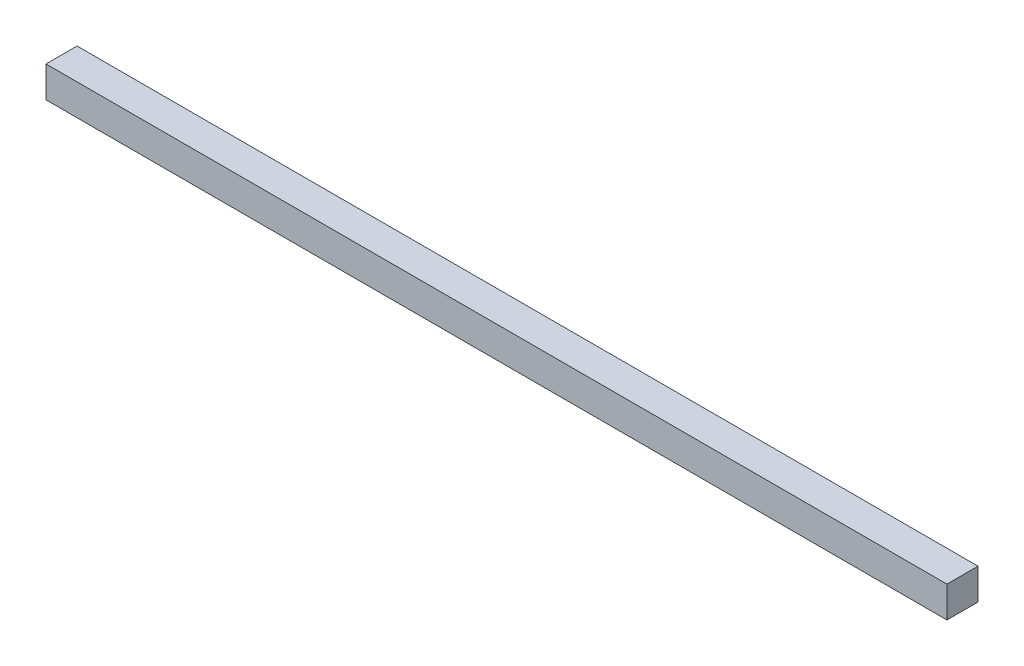
ISO-10303-21;
HEADER;
FILE_DESCRIPTION(('STEP AP214'),'2;1');
FILE_NAME('part.step','',(''),(''),'','','');
FILE_SCHEMA(('AUTOMOTIVE_DESIGN { 1 0 10303 214 1 1 1 1 }'));
ENDSEC;
DATA;
#1=APPLICATION_CONTEXT('core data for automotive mechanical design processes');
#2=APPLICATION_PROTOCOL_DEFINITION('international standard','automotive_design',2000,#1);
#3=PRODUCT_CONTEXT('',#1,'mechanical');
#4=PRODUCT('Part','Part','',(#3));
#5=PRODUCT_RELATED_PRODUCT_CATEGORY('part','',(#4));
#6=PRODUCT_DEFINITION_FORMATION('','',#4);
#7=PRODUCT_DEFINITION_CONTEXT('part definition',#1,'design');
#8=PRODUCT_DEFINITION('design','',#6,#7);
#9=PRODUCT_DEFINITION_SHAPE('','',#8);
#10=(LENGTH_UNIT() NAMED_UNIT(*) SI_UNIT(.MILLI.,.METRE.));
#11=(NAMED_UNIT(*) PLANE_ANGLE_UNIT() SI_UNIT($,.RADIAN.));
#12=(NAMED_UNIT(*) SI_UNIT($,.STERADIAN.) SOLID_ANGLE_UNIT());
#13=UNCERTAINTY_MEASURE_WITH_UNIT(LENGTH_MEASURE(1.E-05),#10,'distance_accuracy_value','');
#14=(GEOMETRIC_REPRESENTATION_CONTEXT(3) GLOBAL_UNCERTAINTY_ASSIGNED_CONTEXT((#13)) GLOBAL_UNIT_ASSIGNED_CONTEXT((#10,
#11,#12)) REPRESENTATION_CONTEXT('',''));
#15=CARTESIAN_POINT('',(0.,0.,0.));
#16=DIRECTION('',(0.,0.,1.));
#17=DIRECTION('',(1.,0.,0.));
#18=AXIS2_PLACEMENT_3D('',#15,#16,#17);
#19=CARTESIAN_POINT('',(0.,0.,1.27));
#20=DIRECTION('',(1.,0.,0.));
#21=DIRECTION('',(0.,0.,-1.));
#22=AXIS2_PLACEMENT_3D('',#19,#20,#21);
#23=PLANE('',#22);
#24=DIRECTION('',(0.,-1.,0.));
#25=VECTOR('',#24,1.);
#26=CARTESIAN_POINT('',(0.,0.,0.));
#27=LINE('',#26,#25);
#28=CARTESIAN_POINT('',(0.,1.27,0.));
#29=VERTEX_POINT('',#28);
#30=CARTESIAN_POINT('',(0.,0.,0.));
#31=VERTEX_POINT('',#30);
#32=EDGE_CURVE('E107',#29,#31,#27,.T.);
#33=ORIENTED_EDGE('',*,*,#32,.T.);
#34=DIRECTION('',(0.,0.,-1.));
#35=VECTOR('',#34,1.);
#36=CARTESIAN_POINT('',(0.,0.,1.27));
#37=LINE('',#36,#35);
#38=CARTESIAN_POINT('',(0.,0.,1.27));
#39=VERTEX_POINT('',#38);
#40=EDGE_CURVE('E11',#39,#31,#37,.T.);
#41=ORIENTED_EDGE('',*,*,#40,.F.);
#42=DIRECTION('',(0.,-1.,0.));
#43=VECTOR('',#42,1.);
#44=CARTESIAN_POINT('',(0.,0.,1.27));
#45=LINE('',#44,#43);
#46=CARTESIAN_POINT('',(0.,1.27,1.27));
#47=VERTEX_POINT('',#46);
#48=EDGE_CURVE('E91',#47,#39,#45,.T.);
#49=ORIENTED_EDGE('',*,*,#48,.F.);
#50=DIRECTION('',(0.,0.,-1.));
#51=VECTOR('',#50,1.);
#52=CARTESIAN_POINT('',(0.,1.27,1.27));
#53=LINE('',#52,#51);
#54=EDGE_CURVE('E103',#47,#29,#53,.T.);
#55=ORIENTED_EDGE('',*,*,#54,.T.);
#56=EDGE_LOOP('',(#33,#41,#49,#55));
#57=FACE_BOUND('',#56,.T.);
#58=ADVANCED_FACE('F39',(#57),#23,.F.);
#59=CARTESIAN_POINT('',(0.,0.,1.27));
#60=DIRECTION('',(0.,1.,0.));
#61=DIRECTION('',(0.,0.,1.));
#62=AXIS2_PLACEMENT_3D('',#59,#60,#61);
#63=PLANE('',#62);
#64=DIRECTION('',(1.,0.,0.));
#65=VECTOR('',#64,1.);
#66=CARTESIAN_POINT('',(0.,0.,0.));
#67=LINE('',#66,#65);
#68=CARTESIAN_POINT('',(36.83,0.,0.));
#69=VERTEX_POINT('',#68);
#70=EDGE_CURVE('E96',#31,#69,#67,.T.);
#71=ORIENTED_EDGE('',*,*,#70,.T.);
#72=DIRECTION('',(0.,0.,-1.));
#73=VECTOR('',#72,1.);
#74=CARTESIAN_POINT('',(36.83,0.,1.27));
#75=LINE('',#74,#73);
#76=CARTESIAN_POINT('',(36.83,0.,1.27));
#77=VERTEX_POINT('',#76);
#78=EDGE_CURVE('E48',#77,#69,#75,.T.);
#79=ORIENTED_EDGE('',*,*,#78,.F.);
#80=DIRECTION('',(1.,0.,0.));
#81=VECTOR('',#80,1.);
#82=CARTESIAN_POINT('',(0.,0.,1.27));
#83=LINE('',#82,#81);
#84=EDGE_CURVE('E86',#39,#77,#83,.T.);
#85=ORIENTED_EDGE('',*,*,#84,.F.);
#86=ORIENTED_EDGE('',*,*,#40,.T.);
#87=EDGE_LOOP('',(#71,#79,#85,#86));
#88=FACE_BOUND('',#87,.T.);
#89=ADVANCED_FACE('F95',(#88),#63,.F.);
#90=CARTESIAN_POINT('',(36.83,0.,1.27));
#91=DIRECTION('',(-1.,0.,0.));
#92=DIRECTION('',(0.,0.,1.));
#93=AXIS2_PLACEMENT_3D('',#90,#91,#92);
#94=PLANE('',#93);
#95=DIRECTION('',(0.,1.,0.));
#96=VECTOR('',#95,1.);
#97=CARTESIAN_POINT('',(36.83,0.,0.));
#98=LINE('',#97,#96);
#99=CARTESIAN_POINT('',(36.83,1.27,0.));
#100=VERTEX_POINT('',#99);
#101=EDGE_CURVE('E73',#69,#100,#98,.T.);
#102=ORIENTED_EDGE('',*,*,#101,.T.);
#103=DIRECTION('',(0.,0.,-1.));
#104=VECTOR('',#103,1.);
#105=CARTESIAN_POINT('',(36.83,1.27,1.27));
#106=LINE('',#105,#104);
#107=CARTESIAN_POINT('',(36.83,1.27,1.27));
#108=VERTEX_POINT('',#107);
#109=EDGE_CURVE('E98',#108,#100,#106,.T.);
#110=ORIENTED_EDGE('',*,*,#109,.F.);
#111=DIRECTION('',(0.,1.,0.));
#112=VECTOR('',#111,1.);
#113=CARTESIAN_POINT('',(36.83,0.,1.27));
#114=LINE('',#113,#112);
#115=EDGE_CURVE('E89',#77,#108,#114,.T.);
#116=ORIENTED_EDGE('',*,*,#115,.F.);
#117=ORIENTED_EDGE('',*,*,#78,.T.);
#118=EDGE_LOOP('',(#102,#110,#116,#117));
#119=FACE_BOUND('',#118,.T.);
#120=ADVANCED_FACE('F99',(#119),#94,.F.);
#121=CARTESIAN_POINT('',(0.,1.27,1.27));
#122=DIRECTION('',(0.,-1.,0.));
#123=DIRECTION('',(0.,0.,-1.));
#124=AXIS2_PLACEMENT_3D('',#121,#122,#123);
#125=PLANE('',#124);
#126=DIRECTION('',(-1.,0.,0.));
#127=VECTOR('',#126,1.);
#128=CARTESIAN_POINT('',(0.,1.27,0.));
#129=LINE('',#128,#127);
#130=EDGE_CURVE('E79',#100,#29,#129,.T.);
#131=ORIENTED_EDGE('',*,*,#130,.T.);
#132=ORIENTED_EDGE('',*,*,#54,.F.);
#133=DIRECTION('',(-1.,0.,0.));
#134=VECTOR('',#133,1.);
#135=CARTESIAN_POINT('',(0.,1.27,1.27));
#136=LINE('',#135,#134);
#137=EDGE_CURVE('E56',#108,#47,#136,.T.);
#138=ORIENTED_EDGE('',*,*,#137,.F.);
#139=ORIENTED_EDGE('',*,*,#109,.T.);
#140=EDGE_LOOP('',(#131,#132,#138,#139));
#141=FACE_BOUND('',#140,.T.);
#142=ADVANCED_FACE('F120',(#141),#125,.F.);
#143=CARTESIAN_POINT('',(0.,0.,1.27));
#144=DIRECTION('',(0.,0.,-1.));
#145=DIRECTION('',(-1.,0.,0.));
#146=AXIS2_PLACEMENT_3D('',#143,#144,#145);
#147=PLANE('',#146);
#148=ORIENTED_EDGE('',*,*,#48,.T.);
#149=ORIENTED_EDGE('',*,*,#84,.T.);
#150=ORIENTED_EDGE('',*,*,#115,.T.);
#151=ORIENTED_EDGE('',*,*,#137,.T.);
#152=EDGE_LOOP('',(#148,#149,#150,#151));
#153=FACE_BOUND('',#152,.T.);
#154=ADVANCED_FACE('F87',(#153),#147,.F.);
#155=CARTESIAN_POINT('',(0.,0.,0.));
#156=DIRECTION('',(0.,0.,-1.));
#157=DIRECTION('',(-1.,0.,0.));
#158=AXIS2_PLACEMENT_3D('',#155,#156,#157);
#159=PLANE('',#158);
#160=ORIENTED_EDGE('',*,*,#32,.F.);
#161=ORIENTED_EDGE('',*,*,#130,.F.);
#162=ORIENTED_EDGE('',*,*,#101,.F.);
#163=ORIENTED_EDGE('',*,*,#70,.F.);
#164=EDGE_LOOP('',(#160,#161,#162,#163));
#165=FACE_BOUND('',#164,.T.);
#166=ADVANCED_FACE('F123',(#165),#159,.T.);
#167=CLOSED_SHELL('',(#58,#89,#120,#142,#154,#166));
#168=MANIFOLD_SOLID_BREP('B2',#167);
#169=ADVANCED_BREP_SHAPE_REPRESENTATION('',(#18,#168),#14);
#170=SHAPE_DEFINITION_REPRESENTATION(#9,#169);
ENDSEC;
END-ISO-10303-21;
